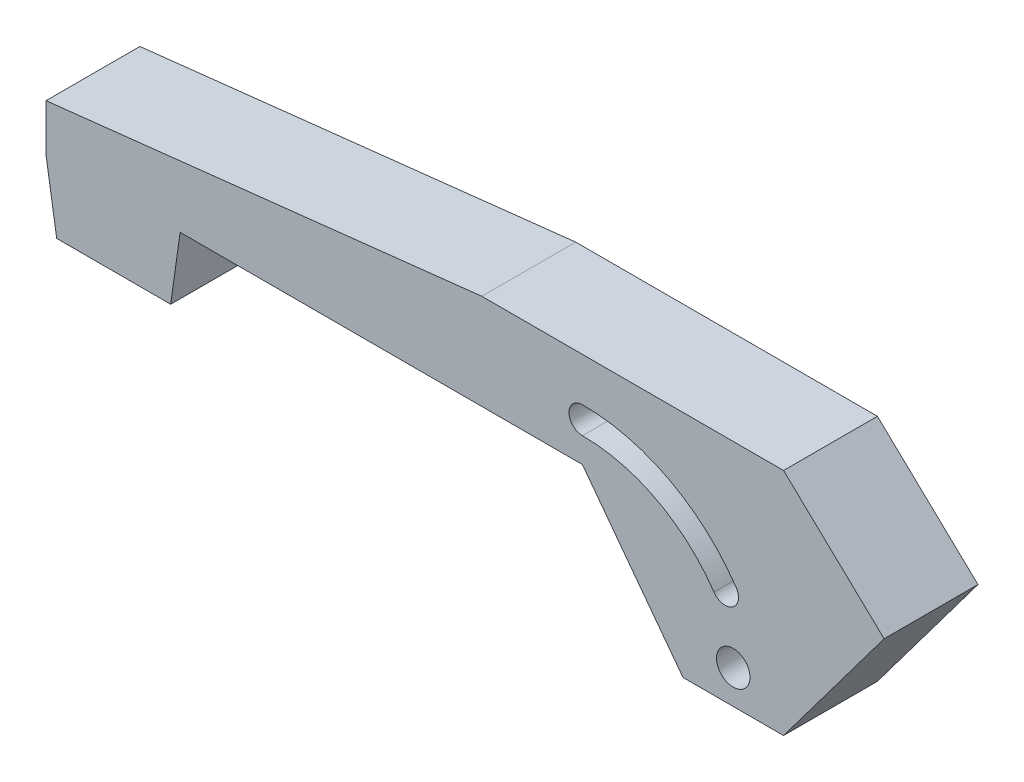
ISO-10303-21;
HEADER;
FILE_DESCRIPTION(('STEP AP214'),'2;1');
FILE_NAME('part.step','',(''),(''),'','','');
FILE_SCHEMA(('AUTOMOTIVE_DESIGN { 1 0 10303 214 1 1 1 1 }'));
ENDSEC;
DATA;
#1=APPLICATION_CONTEXT('core data for automotive mechanical design processes');
#2=APPLICATION_PROTOCOL_DEFINITION('international standard','automotive_design',2000,#1);
#3=PRODUCT_CONTEXT('',#1,'mechanical');
#4=PRODUCT('Part','Part','',(#3));
#5=PRODUCT_RELATED_PRODUCT_CATEGORY('part','',(#4));
#6=PRODUCT_DEFINITION_FORMATION('','',#4);
#7=PRODUCT_DEFINITION_CONTEXT('part definition',#1,'design');
#8=PRODUCT_DEFINITION('design','',#6,#7);
#9=PRODUCT_DEFINITION_SHAPE('','',#8);
#10=(LENGTH_UNIT() NAMED_UNIT(*) SI_UNIT(.MILLI.,.METRE.));
#11=(NAMED_UNIT(*) PLANE_ANGLE_UNIT() SI_UNIT($,.RADIAN.));
#12=(NAMED_UNIT(*) SI_UNIT($,.STERADIAN.) SOLID_ANGLE_UNIT());
#13=UNCERTAINTY_MEASURE_WITH_UNIT(LENGTH_MEASURE(1.E-05),#10,'distance_accuracy_value','');
#14=(GEOMETRIC_REPRESENTATION_CONTEXT(3) GLOBAL_UNCERTAINTY_ASSIGNED_CONTEXT((#13)) GLOBAL_UNIT_ASSIGNED_CONTEXT((#10,
#11,#12)) REPRESENTATION_CONTEXT('',''));
#15=CARTESIAN_POINT('',(0.,0.,0.));
#16=DIRECTION('',(0.,0.,1.));
#17=DIRECTION('',(1.,0.,0.));
#18=AXIS2_PLACEMENT_3D('',#15,#16,#17);
#19=CARTESIAN_POINT('',(0.,0.,7.));
#20=DIRECTION('',(0.,1.,0.));
#21=DIRECTION('',(0.,0.,1.));
#22=AXIS2_PLACEMENT_3D('',#19,#20,#21);
#23=PLANE('',#22);
#24=DIRECTION('',(1.,0.,0.));
#25=VECTOR('',#24,1.);
#26=CARTESIAN_POINT('',(0.,0.,7.));
#27=LINE('',#26,#25);
#28=CARTESIAN_POINT('',(0.8,0.,7.));
#29=VERTEX_POINT('',#28);
#30=CARTESIAN_POINT('',(9.3,0.,7.));
#31=VERTEX_POINT('',#30);
#32=EDGE_CURVE('E160',#29,#31,#27,.T.);
#33=ORIENTED_EDGE('',*,*,#32,.F.);
#34=DIRECTION('',(0.,0.,1.));
#35=VECTOR('',#34,1.);
#36=CARTESIAN_POINT('',(0.8,0.,0.));
#37=LINE('',#36,#35);
#38=CARTESIAN_POINT('',(0.8,0.,0.));
#39=VERTEX_POINT('',#38);
#40=EDGE_CURVE('E146',#39,#29,#37,.T.);
#41=ORIENTED_EDGE('',*,*,#40,.F.);
#42=DIRECTION('',(1.,0.,0.));
#43=VECTOR('',#42,1.);
#44=CARTESIAN_POINT('',(0.,0.,0.));
#45=LINE('',#44,#43);
#46=CARTESIAN_POINT('',(9.3,0.,0.));
#47=VERTEX_POINT('',#46);
#48=EDGE_CURVE('E158',#39,#47,#45,.T.);
#49=ORIENTED_EDGE('',*,*,#48,.T.);
#50=DIRECTION('',(0.,0.,1.));
#51=VECTOR('',#50,1.);
#52=CARTESIAN_POINT('',(9.3,0.,0.));
#53=LINE('',#52,#51);
#54=EDGE_CURVE('E169',#47,#31,#53,.T.);
#55=ORIENTED_EDGE('',*,*,#54,.T.);
#56=EDGE_LOOP('',(#33,#41,#49,#55));
#57=FACE_BOUND('',#56,.T.);
#58=ADVANCED_FACE('F39',(#57),#23,.F.);
#59=CARTESIAN_POINT('',(10.,5.,7.));
#60=DIRECTION('',(0.,1.,0.));
#61=DIRECTION('',(0.,0.,1.));
#62=AXIS2_PLACEMENT_3D('',#59,#60,#61);
#63=PLANE('',#62);
#64=DIRECTION('',(1.,0.,0.));
#65=VECTOR('',#64,1.);
#66=CARTESIAN_POINT('',(10.,5.,0.));
#67=LINE('',#66,#65);
#68=CARTESIAN_POINT('',(10.,5.,0.));
#69=VERTEX_POINT('',#68);
#70=CARTESIAN_POINT('',(40.,5.,0.));
#71=VERTEX_POINT('',#70);
#72=EDGE_CURVE('E168',#69,#71,#67,.T.);
#73=ORIENTED_EDGE('',*,*,#72,.T.);
#74=DIRECTION('',(0.,0.,-1.));
#75=VECTOR('',#74,1.);
#76=CARTESIAN_POINT('',(40.,5.,7.));
#77=LINE('',#76,#75);
#78=CARTESIAN_POINT('',(40.,5.,7.));
#79=VERTEX_POINT('',#78);
#80=EDGE_CURVE('E47',#79,#71,#77,.T.);
#81=ORIENTED_EDGE('',*,*,#80,.F.);
#82=DIRECTION('',(1.,0.,0.));
#83=VECTOR('',#82,1.);
#84=CARTESIAN_POINT('',(10.,5.,7.));
#85=LINE('',#84,#83);
#86=CARTESIAN_POINT('',(10.,5.,7.));
#87=VERTEX_POINT('',#86);
#88=EDGE_CURVE('E482',#87,#79,#85,.T.);
#89=ORIENTED_EDGE('',*,*,#88,.F.);
#90=DIRECTION('',(0.,0.,-1.));
#91=VECTOR('',#90,1.);
#92=CARTESIAN_POINT('',(10.,5.,7.));
#93=LINE('',#92,#91);
#94=EDGE_CURVE('E11',#87,#69,#93,.T.);
#95=ORIENTED_EDGE('',*,*,#94,.T.);
#96=EDGE_LOOP('',(#73,#81,#89,#95));
#97=FACE_BOUND('',#96,.T.);
#98=ADVANCED_FACE('F289',(#97),#63,.F.);
#99=CARTESIAN_POINT('',(40.,5.,7.));
#100=DIRECTION('',(0.8,0.6,0.));
#101=DIRECTION('',(-0.6,0.8,0.));
#102=AXIS2_PLACEMENT_3D('',#99,#100,#101);
#103=PLANE('',#102);
#104=DIRECTION('',(0.6,-0.8,0.));
#105=VECTOR('',#104,1.);
#106=CARTESIAN_POINT('',(40.,5.,0.));
#107=LINE('',#106,#105);
#108=CARTESIAN_POINT('',(47.5,-5.,0.));
#109=VERTEX_POINT('',#108);
#110=EDGE_CURVE('E173',#71,#109,#107,.T.);
#111=ORIENTED_EDGE('',*,*,#110,.T.);
#112=DIRECTION('',(0.,0.,-1.));
#113=VECTOR('',#112,1.);
#114=CARTESIAN_POINT('',(47.5,-5.,7.));
#115=LINE('',#114,#113);
#116=CARTESIAN_POINT('',(47.5,-5.,7.));
#117=VERTEX_POINT('',#116);
#118=EDGE_CURVE('E222',#117,#109,#115,.T.);
#119=ORIENTED_EDGE('',*,*,#118,.F.);
#120=DIRECTION('',(0.6,-0.8,0.));
#121=VECTOR('',#120,1.);
#122=CARTESIAN_POINT('',(40.,5.,7.));
#123=LINE('',#122,#121);
#124=EDGE_CURVE('E233',#79,#117,#123,.T.);
#125=ORIENTED_EDGE('',*,*,#124,.F.);
#126=ORIENTED_EDGE('',*,*,#80,.T.);
#127=EDGE_LOOP('',(#111,#119,#125,#126));
#128=FACE_BOUND('',#127,.T.);
#129=ADVANCED_FACE('F231',(#128),#103,.F.);
#130=CARTESIAN_POINT('',(47.5,-5.,7.));
#131=DIRECTION('',(0.,1.,0.));
#132=DIRECTION('',(0.,0.,1.));
#133=AXIS2_PLACEMENT_3D('',#130,#131,#132);
#134=PLANE('',#133);
#135=DIRECTION('',(1.,0.,0.));
#136=VECTOR('',#135,1.);
#137=CARTESIAN_POINT('',(47.5,-5.,0.));
#138=LINE('',#137,#136);
#139=CARTESIAN_POINT('',(55.,-5.,0.));
#140=VERTEX_POINT('',#139);
#141=EDGE_CURVE('E182',#109,#140,#138,.T.);
#142=ORIENTED_EDGE('',*,*,#141,.T.);
#143=DIRECTION('',(0.,0.,-1.));
#144=VECTOR('',#143,1.);
#145=CARTESIAN_POINT('',(55.,-5.,7.));
#146=LINE('',#145,#144);
#147=CARTESIAN_POINT('',(55.,-5.,7.));
#148=VERTEX_POINT('',#147);
#149=EDGE_CURVE('E218',#148,#140,#146,.T.);
#150=ORIENTED_EDGE('',*,*,#149,.F.);
#151=DIRECTION('',(1.,0.,0.));
#152=VECTOR('',#151,1.);
#153=CARTESIAN_POINT('',(47.5,-5.,7.));
#154=LINE('',#153,#152);
#155=EDGE_CURVE('E252',#117,#148,#154,.T.);
#156=ORIENTED_EDGE('',*,*,#155,.F.);
#157=ORIENTED_EDGE('',*,*,#118,.T.);
#158=EDGE_LOOP('',(#142,#150,#156,#157));
#159=FACE_BOUND('',#158,.T.);
#160=ADVANCED_FACE('F241',(#159),#134,.F.);
#161=CARTESIAN_POINT('',(55.,-5.,7.));
#162=DIRECTION('',(-0.8,0.6,0.));
#163=DIRECTION('',(-0.6,-0.8,0.));
#164=AXIS2_PLACEMENT_3D('',#161,#162,#163);
#165=PLANE('',#164);
#166=DIRECTION('',(0.6,0.8,0.));
#167=VECTOR('',#166,1.);
#168=CARTESIAN_POINT('',(55.,-5.,0.));
#169=LINE('',#168,#167);
#170=CARTESIAN_POINT('',(62.5,5.,0.));
#171=VERTEX_POINT('',#170);
#172=EDGE_CURVE('E185',#140,#171,#169,.T.);
#173=ORIENTED_EDGE('',*,*,#172,.T.);
#174=DIRECTION('',(0.,0.,-1.));
#175=VECTOR('',#174,1.);
#176=CARTESIAN_POINT('',(62.5,5.,7.));
#177=LINE('',#176,#175);
#178=CARTESIAN_POINT('',(62.5,5.,7.));
#179=VERTEX_POINT('',#178);
#180=EDGE_CURVE('E214',#179,#171,#177,.T.);
#181=ORIENTED_EDGE('',*,*,#180,.F.);
#182=DIRECTION('',(0.6,0.8,0.));
#183=VECTOR('',#182,1.);
#184=CARTESIAN_POINT('',(55.,-5.,7.));
#185=LINE('',#184,#183);
#186=EDGE_CURVE('E247',#148,#179,#185,.T.);
#187=ORIENTED_EDGE('',*,*,#186,.F.);
#188=ORIENTED_EDGE('',*,*,#149,.T.);
#189=EDGE_LOOP('',(#173,#181,#187,#188));
#190=FACE_BOUND('',#189,.T.);
#191=ADVANCED_FACE('F245',(#190),#165,.F.);
#192=CARTESIAN_POINT('',(62.5,5.,7.));
#193=DIRECTION('',(-0.688339435709782,-0.725388738020338,0.));
#194=DIRECTION('',(0.725388738020338,-0.688339435709782,0.));
#195=AXIS2_PLACEMENT_3D('',#192,#193,#194);
#196=PLANE('',#195);
#197=DIRECTION('',(-0.725388738020338,0.688339435709782,0.));
#198=VECTOR('',#197,1.);
#199=CARTESIAN_POINT('',(62.5,5.,0.));
#200=LINE('',#199,#198);
#201=CARTESIAN_POINT('',(55.,12.1169367502348,0.));
#202=VERTEX_POINT('',#201);
#203=EDGE_CURVE('E188',#171,#202,#200,.T.);
#204=ORIENTED_EDGE('',*,*,#203,.T.);
#205=DIRECTION('',(0.,0.,-1.));
#206=VECTOR('',#205,1.);
#207=CARTESIAN_POINT('',(55.,12.1169367502348,7.));
#208=LINE('',#207,#206);
#209=CARTESIAN_POINT('',(55.,12.1169367502348,7.));
#210=VERTEX_POINT('',#209);
#211=EDGE_CURVE('E210',#210,#202,#208,.T.);
#212=ORIENTED_EDGE('',*,*,#211,.F.);
#213=DIRECTION('',(-0.725388738020338,0.688339435709782,0.));
#214=VECTOR('',#213,1.);
#215=CARTESIAN_POINT('',(62.5,5.,7.));
#216=LINE('',#215,#214);
#217=EDGE_CURVE('E251',#179,#210,#216,.T.);
#218=ORIENTED_EDGE('',*,*,#217,.F.);
#219=ORIENTED_EDGE('',*,*,#180,.T.);
#220=EDGE_LOOP('',(#204,#212,#218,#219));
#221=FACE_BOUND('',#220,.T.);
#222=ADVANCED_FACE('F278',(#221),#196,.F.);
#223=CARTESIAN_POINT('',(47.5,12.1169367502348,7.));
#224=DIRECTION('',(0.,-1.,0.));
#225=DIRECTION('',(1.,0.,0.));
#226=AXIS2_PLACEMENT_3D('',#223,#224,#225);
#227=PLANE('',#226);
#228=DIRECTION('',(-1.,0.,0.));
#229=VECTOR('',#228,1.);
#230=CARTESIAN_POINT('',(47.5,12.1169367502348,0.));
#231=LINE('',#230,#229);
#232=CARTESIAN_POINT('',(32.5,12.1169367502348,0.));
#233=VERTEX_POINT('',#232);
#234=EDGE_CURVE('E192',#202,#233,#231,.T.);
#235=ORIENTED_EDGE('',*,*,#234,.T.);
#236=DIRECTION('',(0.,0.,-1.));
#237=VECTOR('',#236,1.);
#238=CARTESIAN_POINT('',(32.5,12.1169367502348,7.));
#239=LINE('',#238,#237);
#240=CARTESIAN_POINT('',(32.5,12.1169367502348,7.));
#241=VERTEX_POINT('',#240);
#242=EDGE_CURVE('E206',#241,#233,#239,.T.);
#243=ORIENTED_EDGE('',*,*,#242,.F.);
#244=DIRECTION('',(-1.,0.,0.));
#245=VECTOR('',#244,1.);
#246=CARTESIAN_POINT('',(55.,12.1169367502348,7.));
#247=LINE('',#246,#245);
#248=EDGE_CURVE('E256',#210,#241,#247,.T.);
#249=ORIENTED_EDGE('',*,*,#248,.F.);
#250=ORIENTED_EDGE('',*,*,#211,.T.);
#251=EDGE_LOOP('',(#235,#243,#249,#250));
#252=FACE_BOUND('',#251,.T.);
#253=ADVANCED_FACE('F279',(#252),#227,.F.);
#254=CARTESIAN_POINT('',(0.,8.5,7.));
#255=DIRECTION('',(0.110607502359366,-0.993864165981359,0.));
#256=DIRECTION('',(0.993864165981359,0.110607502359366,0.));
#257=AXIS2_PLACEMENT_3D('',#254,#255,#256);
#258=PLANE('',#257);
#259=DIRECTION('',(-0.993864165981359,-0.110607502359366,0.));
#260=VECTOR('',#259,1.);
#261=CARTESIAN_POINT('',(0.,8.5,0.));
#262=LINE('',#261,#260);
#263=CARTESIAN_POINT('',(0.,8.5,0.));
#264=VERTEX_POINT('',#263);
#265=EDGE_CURVE('E195',#233,#264,#262,.T.);
#266=ORIENTED_EDGE('',*,*,#265,.T.);
#267=DIRECTION('',(0.,0.,-1.));
#268=VECTOR('',#267,1.);
#269=CARTESIAN_POINT('',(0.,8.5,7.));
#270=LINE('',#269,#268);
#271=CARTESIAN_POINT('',(0.,8.5,7.));
#272=VERTEX_POINT('',#271);
#273=EDGE_CURVE('E202',#272,#264,#270,.T.);
#274=ORIENTED_EDGE('',*,*,#273,.F.);
#275=DIRECTION('',(-0.993864165981359,-0.110607502359366,0.));
#276=VECTOR('',#275,1.);
#277=CARTESIAN_POINT('',(0.,8.5,7.));
#278=LINE('',#277,#276);
#279=EDGE_CURVE('E177',#241,#272,#278,.T.);
#280=ORIENTED_EDGE('',*,*,#279,.F.);
#281=ORIENTED_EDGE('',*,*,#242,.T.);
#282=EDGE_LOOP('',(#266,#274,#280,#281));
#283=FACE_BOUND('',#282,.T.);
#284=ADVANCED_FACE('F271',(#283),#258,.F.);
#285=CARTESIAN_POINT('',(0.,5.,7.));
#286=DIRECTION('',(1.,0.,0.));
#287=DIRECTION('',(0.,0.,-1.));
#288=AXIS2_PLACEMENT_3D('',#285,#286,#287);
#289=PLANE('',#288);
#290=DIRECTION('',(0.,-1.,0.));
#291=VECTOR('',#290,1.);
#292=CARTESIAN_POINT('',(0.,5.,0.));
#293=LINE('',#292,#291);
#294=CARTESIAN_POINT('',(0.,5.,0.));
#295=VERTEX_POINT('',#294);
#296=EDGE_CURVE('E198',#264,#295,#293,.T.);
#297=ORIENTED_EDGE('',*,*,#296,.T.);
#298=DIRECTION('',(0.,0.,1.));
#299=VECTOR('',#298,1.);
#300=CARTESIAN_POINT('',(0.,5.,0.));
#301=LINE('',#300,#299);
#302=CARTESIAN_POINT('',(0.,5.,7.));
#303=VERTEX_POINT('',#302);
#304=EDGE_CURVE('E54',#295,#303,#301,.T.);
#305=ORIENTED_EDGE('',*,*,#304,.T.);
#306=DIRECTION('',(0.,-1.,0.));
#307=VECTOR('',#306,1.);
#308=CARTESIAN_POINT('',(0.,0.,7.));
#309=LINE('',#308,#307);
#310=EDGE_CURVE('E201',#272,#303,#309,.T.);
#311=ORIENTED_EDGE('',*,*,#310,.F.);
#312=ORIENTED_EDGE('',*,*,#273,.T.);
#313=EDGE_LOOP('',(#297,#305,#311,#312));
#314=FACE_BOUND('',#313,.T.);
#315=ADVANCED_FACE('F274',(#314),#289,.F.);
#316=CARTESIAN_POINT('',(0.,0.,7.));
#317=DIRECTION('',(0.,0.,1.));
#318=DIRECTION('',(1.,0.,0.));
#319=AXIS2_PLACEMENT_3D('',#316,#317,#318);
#320=PLANE('',#319);
#321=DIRECTION('',(-0.157990501106673,0.987440631916705,0.));
#322=VECTOR('',#321,1.);
#323=CARTESIAN_POINT('',(0.8,0.,7.));
#324=LINE('',#323,#322);
#325=EDGE_CURVE('E153',#29,#303,#324,.T.);
#326=ORIENTED_EDGE('',*,*,#325,.F.);
#327=ORIENTED_EDGE('',*,*,#32,.T.);
#328=DIRECTION('',(-0.138647844534406,-0.99034174667433,0.));
#329=VECTOR('',#328,1.);
#330=CARTESIAN_POINT('',(10.,5.,7.));
#331=LINE('',#330,#329);
#332=EDGE_CURVE('E467',#87,#31,#331,.T.);
#333=ORIENTED_EDGE('',*,*,#332,.F.);
#334=ORIENTED_EDGE('',*,*,#88,.T.);
#335=ORIENTED_EDGE('',*,*,#124,.T.);
#336=ORIENTED_EDGE('',*,*,#155,.T.);
#337=ORIENTED_EDGE('',*,*,#186,.T.);
#338=ORIENTED_EDGE('',*,*,#217,.T.);
#339=ORIENTED_EDGE('',*,*,#248,.T.);
#340=ORIENTED_EDGE('',*,*,#279,.T.);
#341=ORIENTED_EDGE('',*,*,#310,.T.);
#342=EDGE_LOOP('',(#326,#327,#333,#334,#335,#336,#337,#338,#339,#340,#341));
#343=FACE_BOUND('',#342,.T.);
#344=CARTESIAN_POINT('',(51.25,-2.5,7.));
#345=DIRECTION('',(0.,0.,1.));
#346=DIRECTION('',(1.,0.,0.));
#347=AXIS2_PLACEMENT_3D('',#344,#345,#346);
#348=CIRCLE('',#347,1.25);
#349=CARTESIAN_POINT('',(52.5,-2.5,7.));
#350=VERTEX_POINT('',#349);
#351=EDGE_CURVE('E490',#350,#350,#348,.T.);
#352=ORIENTED_EDGE('',*,*,#351,.F.);
#353=EDGE_LOOP('',(#352));
#354=FACE_BOUND('',#353,.T.);
#355=CARTESIAN_POINT('',(50.6415336494058,2.23011706444534,7.));
#356=DIRECTION('',(0.,0.,1.));
#357=DIRECTION('',(1.,0.,0.));
#358=AXIS2_PLACEMENT_3D('',#355,#356,#357);
#359=CIRCLE('',#358,1.);
#360=CARTESIAN_POINT('',(49.8143858073242,1.66813268090802,7.));
#361=VERTEX_POINT('',#360);
#362=CARTESIAN_POINT('',(51.4686814914874,2.79210144798267,7.));
#363=VERTEX_POINT('',#362);
#364=EDGE_CURVE('E62',#361,#363,#359,.T.);
#365=ORIENTED_EDGE('',*,*,#364,.F.);
#366=CARTESIAN_POINT('',(40.,-5.,7.));
#367=DIRECTION('',(0.,0.,1.));
#368=DIRECTION('',(1.,0.,0.));
#369=AXIS2_PLACEMENT_3D('',#366,#367,#368);
#370=CIRCLE('',#369,11.8653344759093);
#371=CARTESIAN_POINT('',(40.,6.86533447590927,7.));
#372=VERTEX_POINT('',#371);
#373=EDGE_CURVE('E460',#361,#372,#370,.T.);
#374=ORIENTED_EDGE('',*,*,#373,.T.);
#375=CARTESIAN_POINT('',(40.,7.86533447590927,7.));
#376=DIRECTION('',(0.,0.,1.));
#377=DIRECTION('',(1.,0.,0.));
#378=AXIS2_PLACEMENT_3D('',#375,#376,#377);
#379=CIRCLE('',#378,1.);
#380=CARTESIAN_POINT('',(40.,8.86533447590927,7.));
#381=VERTEX_POINT('',#380);
#382=EDGE_CURVE('E456',#381,#372,#379,.T.);
#383=ORIENTED_EDGE('',*,*,#382,.F.);
#384=CARTESIAN_POINT('',(40.,-5.,7.));
#385=DIRECTION('',(0.,0.,1.));
#386=DIRECTION('',(1.,0.,0.));
#387=AXIS2_PLACEMENT_3D('',#384,#385,#386);
#388=CIRCLE('',#387,13.8653344759093);
#389=EDGE_CURVE('E452',#363,#381,#388,.T.);
#390=ORIENTED_EDGE('',*,*,#389,.F.);
#391=EDGE_LOOP('',(#365,#374,#383,#390));
#392=FACE_BOUND('',#391,.T.);
#393=ADVANCED_FACE('F268',(#343,#354,#392),#320,.T.);
#394=CARTESIAN_POINT('',(0.,0.,0.));
#395=DIRECTION('',(0.,0.,1.));
#396=DIRECTION('',(1.,0.,0.));
#397=AXIS2_PLACEMENT_3D('',#394,#395,#396);
#398=PLANE('',#397);
#399=CARTESIAN_POINT('',(51.25,-2.5,0.));
#400=DIRECTION('',(0.,0.,1.));
#401=DIRECTION('',(1.,0.,0.));
#402=AXIS2_PLACEMENT_3D('',#399,#400,#401);
#403=CIRCLE('',#402,1.25);
#404=CARTESIAN_POINT('',(52.5,-2.5,0.));
#405=VERTEX_POINT('',#404);
#406=EDGE_CURVE('E429',#405,#405,#403,.T.);
#407=ORIENTED_EDGE('',*,*,#406,.T.);
#408=EDGE_LOOP('',(#407));
#409=FACE_BOUND('',#408,.T.);
#410=CARTESIAN_POINT('',(40.,-5.,0.));
#411=DIRECTION('',(0.,0.,1.));
#412=DIRECTION('',(1.,0.,0.));
#413=AXIS2_PLACEMENT_3D('',#410,#411,#412);
#414=CIRCLE('',#413,11.8653344759093);
#415=CARTESIAN_POINT('',(49.8143858073242,1.66813268090802,0.));
#416=VERTEX_POINT('',#415);
#417=CARTESIAN_POINT('',(40.,6.86533447590927,0.));
#418=VERTEX_POINT('',#417);
#419=EDGE_CURVE('E433',#416,#418,#414,.T.);
#420=ORIENTED_EDGE('',*,*,#419,.F.);
#421=CARTESIAN_POINT('',(50.6415336494058,2.23011706444534,0.));
#422=DIRECTION('',(0.,0.,1.));
#423=DIRECTION('',(1.,0.,0.));
#424=AXIS2_PLACEMENT_3D('',#421,#422,#423);
#425=CIRCLE('',#424,1.);
#426=CARTESIAN_POINT('',(51.4686814914874,2.79210144798267,0.));
#427=VERTEX_POINT('',#426);
#428=EDGE_CURVE('E436',#416,#427,#425,.T.);
#429=ORIENTED_EDGE('',*,*,#428,.T.);
#430=CARTESIAN_POINT('',(40.,-5.,0.));
#431=DIRECTION('',(0.,0.,1.));
#432=DIRECTION('',(1.,0.,0.));
#433=AXIS2_PLACEMENT_3D('',#430,#431,#432);
#434=CIRCLE('',#433,13.8653344759093);
#435=CARTESIAN_POINT('',(40.,8.86533447590927,0.));
#436=VERTEX_POINT('',#435);
#437=EDGE_CURVE('E446',#427,#436,#434,.T.);
#438=ORIENTED_EDGE('',*,*,#437,.T.);
#439=CARTESIAN_POINT('',(40.,7.86533447590927,0.));
#440=DIRECTION('',(0.,0.,1.));
#441=DIRECTION('',(1.,0.,0.));
#442=AXIS2_PLACEMENT_3D('',#439,#440,#441);
#443=CIRCLE('',#442,1.);
#444=EDGE_CURVE('E437',#436,#418,#443,.T.);
#445=ORIENTED_EDGE('',*,*,#444,.T.);
#446=EDGE_LOOP('',(#420,#429,#438,#445));
#447=FACE_BOUND('',#446,.T.);
#448=ORIENTED_EDGE('',*,*,#48,.F.);
#449=DIRECTION('',(-0.157990501106673,0.987440631916705,0.));
#450=VECTOR('',#449,1.);
#451=CARTESIAN_POINT('',(0.8,0.,0.));
#452=LINE('',#451,#450);
#453=EDGE_CURVE('E143',#39,#295,#452,.T.);
#454=ORIENTED_EDGE('',*,*,#453,.T.);
#455=ORIENTED_EDGE('',*,*,#296,.F.);
#456=ORIENTED_EDGE('',*,*,#265,.F.);
#457=ORIENTED_EDGE('',*,*,#234,.F.);
#458=ORIENTED_EDGE('',*,*,#203,.F.);
#459=ORIENTED_EDGE('',*,*,#172,.F.);
#460=ORIENTED_EDGE('',*,*,#141,.F.);
#461=ORIENTED_EDGE('',*,*,#110,.F.);
#462=ORIENTED_EDGE('',*,*,#72,.F.);
#463=DIRECTION('',(-0.138647844534406,-0.99034174667433,0.));
#464=VECTOR('',#463,1.);
#465=CARTESIAN_POINT('',(10.,5.,0.));
#466=LINE('',#465,#464);
#467=EDGE_CURVE('E166',#69,#47,#466,.T.);
#468=ORIENTED_EDGE('',*,*,#467,.T.);
#469=EDGE_LOOP('',(#448,#454,#455,#456,#457,#458,#459,#460,#461,#462,#468));
#470=FACE_BOUND('',#469,.T.);
#471=ADVANCED_FACE('F164',(#409,#447,#470),#398,.F.);
#472=CARTESIAN_POINT('',(10.,5.,0.));
#473=DIRECTION('',(-0.99034174667433,0.138647844534406,0.));
#474=DIRECTION('',(-0.138647844534406,-0.99034174667433,0.));
#475=AXIS2_PLACEMENT_3D('',#472,#473,#474);
#476=PLANE('',#475);
#477=ORIENTED_EDGE('',*,*,#332,.T.);
#478=ORIENTED_EDGE('',*,*,#54,.F.);
#479=ORIENTED_EDGE('',*,*,#467,.F.);
#480=ORIENTED_EDGE('',*,*,#94,.F.);
#481=EDGE_LOOP('',(#477,#478,#479,#480));
#482=FACE_BOUND('',#481,.T.);
#483=ADVANCED_FACE('F333',(#482),#476,.F.);
#484=CARTESIAN_POINT('',(50.6415336494058,2.23011706444534,0.));
#485=DIRECTION('',(0.,0.,1.));
#486=DIRECTION('',(1.,0.,0.));
#487=AXIS2_PLACEMENT_3D('',#484,#485,#486);
#488=CYLINDRICAL_SURFACE('',#487,1.);
#489=ORIENTED_EDGE('',*,*,#364,.T.);
#490=DIRECTION('',(0.,0.,1.));
#491=VECTOR('',#490,1.);
#492=CARTESIAN_POINT('',(51.4686814914874,2.79210144798267,0.));
#493=LINE('',#492,#491);
#494=EDGE_CURVE('E440',#427,#363,#493,.T.);
#495=ORIENTED_EDGE('',*,*,#494,.F.);
#496=ORIENTED_EDGE('',*,*,#428,.F.);
#497=DIRECTION('',(0.,0.,1.));
#498=VECTOR('',#497,1.);
#499=CARTESIAN_POINT('',(49.8143858073242,1.66813268090802,0.));
#500=LINE('',#499,#498);
#501=EDGE_CURVE('E464',#416,#361,#500,.T.);
#502=ORIENTED_EDGE('',*,*,#501,.T.);
#503=EDGE_LOOP('',(#489,#495,#496,#502));
#504=FACE_BOUND('',#503,.T.);
#505=ADVANCED_FACE('F338',(#504),#488,.F.);
#506=CARTESIAN_POINT('',(40.,-5.,0.));
#507=DIRECTION('',(0.,0.,1.));
#508=DIRECTION('',(1.,0.,0.));
#509=AXIS2_PLACEMENT_3D('',#506,#507,#508);
#510=CYLINDRICAL_SURFACE('',#509,11.8653344759093);
#511=ORIENTED_EDGE('',*,*,#373,.F.);
#512=ORIENTED_EDGE('',*,*,#501,.F.);
#513=ORIENTED_EDGE('',*,*,#419,.T.);
#514=DIRECTION('',(0.,0.,1.));
#515=VECTOR('',#514,1.);
#516=CARTESIAN_POINT('',(40.,6.86533447590927,0.));
#517=LINE('',#516,#515);
#518=EDGE_CURVE('E468',#418,#372,#517,.T.);
#519=ORIENTED_EDGE('',*,*,#518,.T.);
#520=EDGE_LOOP('',(#511,#512,#513,#519));
#521=FACE_BOUND('',#520,.T.);
#522=ADVANCED_FACE('F350',(#521),#510,.T.);
#523=CARTESIAN_POINT('',(40.,7.86533447590927,0.));
#524=DIRECTION('',(0.,0.,1.));
#525=DIRECTION('',(1.,0.,0.));
#526=AXIS2_PLACEMENT_3D('',#523,#524,#525);
#527=CYLINDRICAL_SURFACE('',#526,1.);
#528=ORIENTED_EDGE('',*,*,#382,.T.);
#529=ORIENTED_EDGE('',*,*,#518,.F.);
#530=ORIENTED_EDGE('',*,*,#444,.F.);
#531=DIRECTION('',(0.,0.,1.));
#532=VECTOR('',#531,1.);
#533=CARTESIAN_POINT('',(40.,8.86533447590927,0.));
#534=LINE('',#533,#532);
#535=EDGE_CURVE('E444',#436,#381,#534,.T.);
#536=ORIENTED_EDGE('',*,*,#535,.T.);
#537=EDGE_LOOP('',(#528,#529,#530,#536));
#538=FACE_BOUND('',#537,.T.);
#539=ADVANCED_FACE('F359',(#538),#527,.F.);
#540=CARTESIAN_POINT('',(40.,-5.,0.));
#541=DIRECTION('',(0.,0.,1.));
#542=DIRECTION('',(1.,0.,0.));
#543=AXIS2_PLACEMENT_3D('',#540,#541,#542);
#544=CYLINDRICAL_SURFACE('',#543,13.8653344759093);
#545=ORIENTED_EDGE('',*,*,#389,.T.);
#546=ORIENTED_EDGE('',*,*,#535,.F.);
#547=ORIENTED_EDGE('',*,*,#437,.F.);
#548=ORIENTED_EDGE('',*,*,#494,.T.);
#549=EDGE_LOOP('',(#545,#546,#547,#548));
#550=FACE_BOUND('',#549,.T.);
#551=ADVANCED_FACE('F369',(#550),#544,.F.);
#552=CARTESIAN_POINT('',(51.25,-2.5,0.));
#553=DIRECTION('',(0.,0.,1.));
#554=DIRECTION('',(1.,0.,0.));
#555=AXIS2_PLACEMENT_3D('',#552,#553,#554);
#556=CYLINDRICAL_SURFACE('',#555,1.25);
#557=ORIENTED_EDGE('',*,*,#406,.F.);
#558=EDGE_LOOP('',(#557));
#559=FACE_BOUND('',#558,.T.);
#560=ORIENTED_EDGE('',*,*,#351,.T.);
#561=EDGE_LOOP('',(#560));
#562=FACE_BOUND('',#561,.T.);
#563=ADVANCED_FACE('F379',(#559,#562),#556,.F.);
#564=CARTESIAN_POINT('',(0.8,0.,0.));
#565=DIRECTION('',(0.987440631916705,0.157990501106673,0.));
#566=DIRECTION('',(-0.157990501106673,0.987440631916705,0.));
#567=AXIS2_PLACEMENT_3D('',#564,#565,#566);
#568=PLANE('',#567);
#569=ORIENTED_EDGE('',*,*,#325,.T.);
#570=ORIENTED_EDGE('',*,*,#304,.F.);
#571=ORIENTED_EDGE('',*,*,#453,.F.);
#572=ORIENTED_EDGE('',*,*,#40,.T.);
#573=EDGE_LOOP('',(#569,#570,#571,#572));
#574=FACE_BOUND('',#573,.T.);
#575=ADVANCED_FACE('F145',(#574),#568,.F.);
#576=CLOSED_SHELL('',(#58,#98,#129,#160,#191,#222,#253,#284,#315,#393,#471,#483,#505,#522,#539,
#551,#563,#575));
#577=MANIFOLD_SOLID_BREP('B2',#576);
#578=ADVANCED_BREP_SHAPE_REPRESENTATION('',(#18,#577),#14);
#579=SHAPE_DEFINITION_REPRESENTATION(#9,#578);
ENDSEC;
END-ISO-10303-21;
